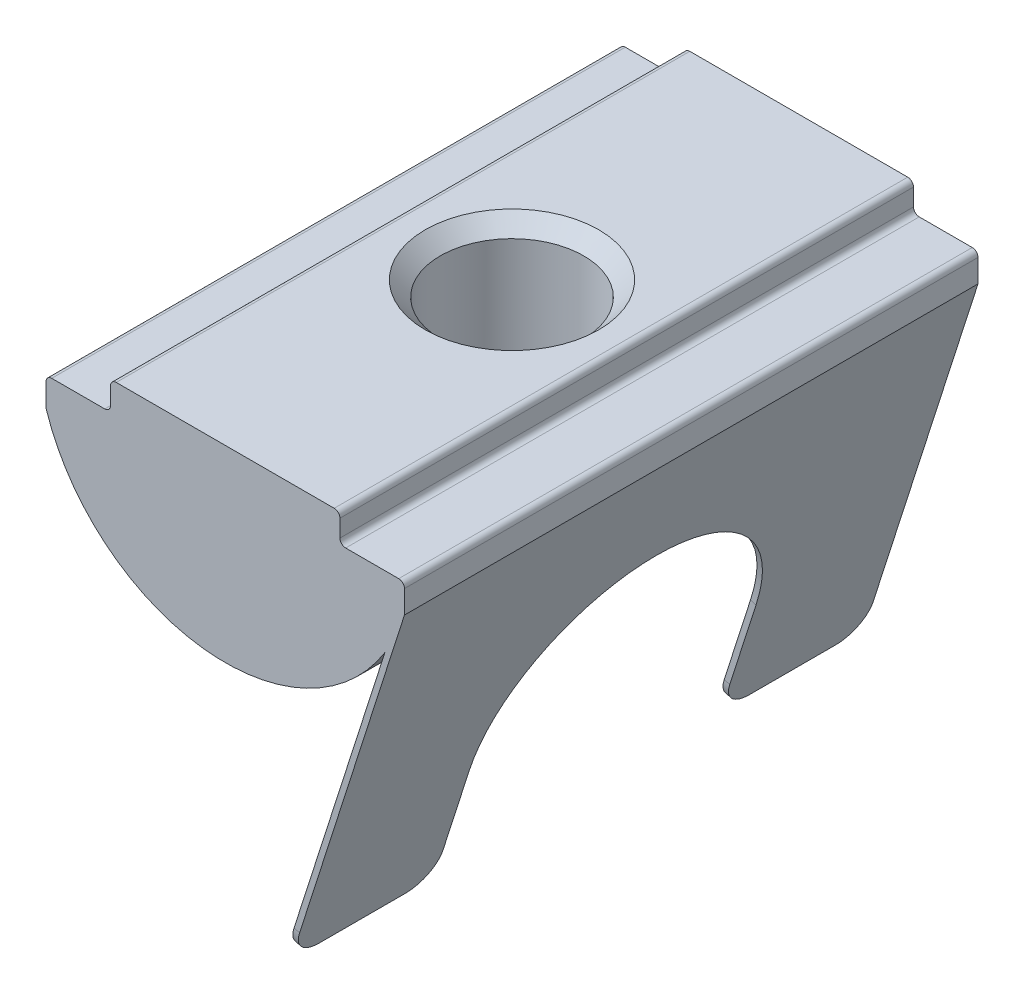
ISO-10303-21;
HEADER;
FILE_DESCRIPTION(('STEP AP214'),'2;1');
FILE_NAME('part.step','',(''),(''),'','','');
FILE_SCHEMA(('AUTOMOTIVE_DESIGN { 1 0 10303 214 1 1 1 1 }'));
ENDSEC;
DATA;
#1=APPLICATION_CONTEXT('core data for automotive mechanical design processes');
#2=APPLICATION_PROTOCOL_DEFINITION('international standard','automotive_design',2000,#1);
#3=PRODUCT_CONTEXT('',#1,'mechanical');
#4=PRODUCT('Part','Part','',(#3));
#5=PRODUCT_RELATED_PRODUCT_CATEGORY('part','',(#4));
#6=PRODUCT_DEFINITION_FORMATION('','',#4);
#7=PRODUCT_DEFINITION_CONTEXT('part definition',#1,'design');
#8=PRODUCT_DEFINITION('design','',#6,#7);
#9=PRODUCT_DEFINITION_SHAPE('','',#8);
#10=(LENGTH_UNIT() NAMED_UNIT(*) SI_UNIT(.MILLI.,.METRE.));
#11=(NAMED_UNIT(*) PLANE_ANGLE_UNIT() SI_UNIT($,.RADIAN.));
#12=(NAMED_UNIT(*) SI_UNIT($,.STERADIAN.) SOLID_ANGLE_UNIT());
#13=UNCERTAINTY_MEASURE_WITH_UNIT(LENGTH_MEASURE(1.E-05),#10,'distance_accuracy_value','');
#14=(GEOMETRIC_REPRESENTATION_CONTEXT(3) GLOBAL_UNCERTAINTY_ASSIGNED_CONTEXT((#13)) GLOBAL_UNIT_ASSIGNED_CONTEXT((#10,
#11,#12)) REPRESENTATION_CONTEXT('',''));
#15=CARTESIAN_POINT('',(0.,0.,0.));
#16=DIRECTION('',(0.,0.,1.));
#17=DIRECTION('',(1.,0.,0.));
#18=AXIS2_PLACEMENT_3D('',#15,#16,#17);
#19=CARTESIAN_POINT('',(2.09743071821094,-14.3205587681705,10.));
#20=DIRECTION('',(0.304775727103784,0.952424147199324,0.));
#21=DIRECTION('',(-0.952424147199324,0.304775727103784,0.));
#22=AXIS2_PLACEMENT_3D('',#19,#20,#21);
#23=PLANE('',#22);
#24=DIRECTION('',(0.,0.,-1.));
#25=VECTOR('',#24,1.);
#26=CARTESIAN_POINT('',(2.09743071821094,-14.3205587681705,10.));
#27=LINE('',#26,#25);
#28=CARTESIAN_POINT('',(2.09743071821094,-14.3205587681705,9.));
#29=VERTEX_POINT('',#28);
#30=CARTESIAN_POINT('',(2.09743071821094,-14.3205587681705,6.));
#31=VERTEX_POINT('',#30);
#32=EDGE_CURVE('E408',#29,#31,#27,.T.);
#33=ORIENTED_EDGE('',*,*,#32,.T.);
#34=DIRECTION('',(0.952424147199324,-0.304775727103784,0.));
#35=VECTOR('',#34,1.);
#36=CARTESIAN_POINT('',(2.09743071821094,-14.3205587681705,6.));
#37=LINE('',#36,#35);
#38=CARTESIAN_POINT('',(2.28791554765081,-14.3815139135912,6.));
#39=VERTEX_POINT('',#38);
#40=EDGE_CURVE('E364',#31,#39,#37,.T.);
#41=ORIENTED_EDGE('',*,*,#40,.T.);
#42=DIRECTION('',(0.,0.,-1.));
#43=VECTOR('',#42,1.);
#44=CARTESIAN_POINT('',(2.28791554765081,-14.3815139135912,10.));
#45=LINE('',#44,#43);
#46=CARTESIAN_POINT('',(2.28791554765081,-14.3815139135912,9.));
#47=VERTEX_POINT('',#46);
#48=EDGE_CURVE('E339',#47,#39,#45,.T.);
#49=ORIENTED_EDGE('',*,*,#48,.F.);
#50=DIRECTION('',(0.952424147199324,-0.304775727103784,0.));
#51=VECTOR('',#50,1.);
#52=CARTESIAN_POINT('',(2.09743071821094,-14.3205587681705,9.));
#53=LINE('',#52,#51);
#54=EDGE_CURVE('E362',#47,#29,#53,.F.);
#55=ORIENTED_EDGE('',*,*,#54,.T.);
#56=EDGE_LOOP('',(#33,#41,#49,#55));
#57=FACE_BOUND('',#56,.T.);
#58=ADVANCED_FACE('F37',(#57),#23,.F.);
#59=CARTESIAN_POINT('',(0.,0.,10.));
#60=DIRECTION('',(0.,0.,-1.));
#61=DIRECTION('',(-1.,0.,0.));
#62=AXIS2_PLACEMENT_3D('',#59,#60,#61);
#63=CYLINDRICAL_SURFACE('',#62,6.56220237420334);
#64=CARTESIAN_POINT('',(0.,-6.56220237420334,2.5));
#65=CARTESIAN_POINT('',(0.135237969727322,-6.5622066098918,2.50000559090245));
#66=CARTESIAN_POINT('',(0.270438294165238,-6.55798574884076,2.48899237795468));
#67=CARTESIAN_POINT('',(0.536790067596159,-6.54157082288729,2.44541562857021));
#68=CARTESIAN_POINT('',(0.66794223689422,-6.52937818510092,2.41285594939247));
#69=CARTESIAN_POINT('',(0.922317274417645,-6.49832593562565,2.3275105667938));
#70=CARTESIAN_POINT('',(1.04555518470677,-6.47947944209069,2.27476464372538));
#71=CARTESIAN_POINT('',(1.28142189377812,-6.43698980028419,2.15074975378287));
#72=CARTESIAN_POINT('',(1.39404774154593,-6.41334532351474,2.07947565516312));
#73=CARTESIAN_POINT('',(1.61040689382471,-6.36254100296364,1.91718290169649));
#74=CARTESIAN_POINT('',(1.7136163655667,-6.33527948599431,1.82549804417402));
#75=CARTESIAN_POINT('',(1.90361954452212,-6.2808056589463,1.62640061830623));
#76=CARTESIAN_POINT('',(1.99040799009793,-6.25359336739741,1.5189830283602));
#77=CARTESIAN_POINT('',(2.14849031868706,-6.20110584528917,1.28628876369987));
#78=CARTESIAN_POINT('',(2.21903508018268,-6.17594989288392,1.16047355196513));
#79=CARTESIAN_POINT('',(2.33772933390275,-6.13201086715651,0.89765620395099));
#80=CARTESIAN_POINT('',(2.3858880983818,-6.1132251561613,0.760658727044491));
#81=CARTESIAN_POINT('',(2.45636012527362,-6.08524333193476,0.485402970483944));
#82=CARTESIAN_POINT('',(2.47967537946486,-6.07567706705736,0.347440147986682));
#83=CARTESIAN_POINT('',(2.50293096270891,-6.0661363899596,0.0692540501262569));
#84=CARTESIAN_POINT('',(2.50288134755941,-6.06615785136304,-0.0709682268271353));
#85=CARTESIAN_POINT('',(2.48017311798589,-6.07547185819711,-0.340420801195307));
#86=CARTESIAN_POINT('',(2.45891837287933,-6.08418872632706,-0.46979304273857));
#87=CARTESIAN_POINT('',(2.39672872804262,-6.10895243063458,-0.722973167947636));
#88=CARTESIAN_POINT('',(2.3557907665065,-6.12500040717709,-0.846780182641857));
#89=CARTESIAN_POINT('',(2.25464716104957,-6.16295558593987,-1.08812773461316));
#90=CARTESIAN_POINT('',(2.19408503593202,-6.18496985318855,-1.20550129697871));
#91=CARTESIAN_POINT('',(2.05566109372734,-6.23234297311382,-1.42882173607091));
#92=CARTESIAN_POINT('',(1.97779317084308,-6.25770300494994,-1.53476456018153));
#93=CARTESIAN_POINT('',(1.80059453364382,-6.31106076406311,-1.73996727508045));
#94=CARTESIAN_POINT('',(1.70014783768017,-6.33911927919591,-1.83825008747681));
#95=CARTESIAN_POINT('',(1.48388058500153,-6.39320034448105,-2.01687157132359));
#96=CARTESIAN_POINT('',(1.36805751636075,-6.41922256087178,-2.09720730512577));
#97=CARTESIAN_POINT('',(1.12176812531848,-6.46684633871997,-2.23877853844));
#98=CARTESIAN_POINT('',(0.991092617477647,-6.48836831111416,-2.29967881040701));
#99=CARTESIAN_POINT('',(0.720326163224393,-6.52397374555269,-2.39830435029323));
#100=CARTESIAN_POINT('',(0.580239571346992,-6.5380606214764,-2.43604025560212));
#101=CARTESIAN_POINT('',(0.30284307236105,-6.55660336858607,-2.48536473017634));
#102=CARTESIAN_POINT('',(0.165799155746944,-6.56154308249374,-2.4982684066475));
#103=CARTESIAN_POINT('',(-0.108569560725787,-6.56273688938799,-2.50140406044084));
#104=CARTESIAN_POINT('',(-0.245894288641204,-6.55899298208926,-2.49164125753091));
#105=CARTESIAN_POINT('',(-0.511178796961527,-6.54355896320154,-2.4507133564302));
#106=CARTESIAN_POINT('',(-0.639293584119852,-6.53219203239229,-2.42041820128547));
#107=CARTESIAN_POINT('',(-0.888525112222872,-6.50298230614948,-2.34043991811526));
#108=CARTESIAN_POINT('',(-1.00964094199354,-6.48513866972419,-2.29075427219697));
#109=CARTESIAN_POINT('',(-1.24547398507779,-6.44407126786509,-2.17180910315483));
#110=CARTESIAN_POINT('',(-1.35989405648471,-6.42070336715714,-2.10201173551177));
#111=CARTESIAN_POINT('',(-1.57578627748461,-6.37116049204239,-1.94542955336869));
#112=CARTESIAN_POINT('',(-1.67725351756103,-6.34498446014602,-1.8586383290765));
#113=CARTESIAN_POINT('',(-1.8707222682355,-6.29075464835007,-1.66441869640802));
#114=CARTESIAN_POINT('',(-1.96179260631359,-6.26268231760205,-1.55606547646505));
#115=CARTESIAN_POINT('',(-2.12465242533068,-6.20932501921404,-1.32507440268299));
#116=CARTESIAN_POINT('',(-2.19643986730368,-6.18404034650645,-1.20243504019683));
#117=CARTESIAN_POINT('',(-2.31885011487335,-6.139196109236,-0.945158222699218));
#118=CARTESIAN_POINT('',(-2.36935793657373,-6.11966781525425,-0.810460235131746));
#119=CARTESIAN_POINT('',(-2.44662901393818,-6.08919247750817,-0.533515110525692));
#120=CARTESIAN_POINT('',(-2.47340760775104,-6.07823989109353,-0.391272913049802));
#121=CARTESIAN_POINT('',(-2.50106641197949,-6.06690770485394,-0.113403243873322));
#122=CARTESIAN_POINT('',(-2.50354106563636,-6.06587726377154,0.0220402142339864));
#123=CARTESIAN_POINT('',(-2.48663064429201,-6.07282885779216,0.291306728413155));
#124=CARTESIAN_POINT('',(-2.46724778375513,-6.08080997990102,0.425129947249094));
#125=CARTESIAN_POINT('',(-2.40842883548723,-6.10433590438406,0.682929434330561));
#126=CARTESIAN_POINT('',(-2.36966536663656,-6.11962629938865,0.807084400051815));
#127=CARTESIAN_POINT('',(-2.27378641928747,-6.15589224411625,1.04719592320177));
#128=CARTESIAN_POINT('',(-2.21666623282566,-6.17686925207367,1.16315036811762));
#129=CARTESIAN_POINT('',(-2.0821447559704,-6.22354349256986,1.39033189832229));
#130=CARTESIAN_POINT('',(-2.00382030521855,-6.24943349746364,1.50097222563478));
#131=CARTESIAN_POINT('',(-1.83052366787169,-6.30237140427464,1.70804729807096));
#132=CARTESIAN_POINT('',(-1.73554610477584,-6.32941967800402,1.80447743683685));
#133=CARTESIAN_POINT('',(-1.52522171500721,-6.38346458088073,1.98596451770642));
#134=CARTESIAN_POINT('',(-1.40902654879827,-6.41037173144652,2.07006949925358));
#135=CARTESIAN_POINT('',(-1.16320296590711,-6.45950143502143,2.21754467691023));
#136=CARTESIAN_POINT('',(-1.03357276443138,-6.4817233644238,2.28091211345463));
#137=CARTESIAN_POINT('',(-0.756694602572169,-6.52000719349644,2.38760023502498));
#138=CARTESIAN_POINT('',(-0.608863961792611,-6.53564687786252,2.42957584223565));
#139=CARTESIAN_POINT('',(-0.307337189901119,-6.55673928800033,2.48576498850311));
#140=CARTESIAN_POINT('',(-0.153644299986202,-6.56219756202383,2.49999364815742));
#141=CARTESIAN_POINT('',(0.,-6.56220237420334,2.5));
#142=B_SPLINE_CURVE_WITH_KNOTS('',3,(#64,#65,#66,#67,#68,#69,#70,#71,#72,#73,#74,#75,#76,#77,
#78,#79,#80,#81,#82,#83,#84,#85,#86,#87,#88,#89,#90,#91,#92,#93,#94,#95,#96,#97,#98,#99,#100,
#101,#102,#103,#104,#105,#106,#107,#108,#109,#110,#111,#112,#113,#114,#115,#116,#117,#118,#119,
#120,#121,#122,#123,#124,#125,#126,#127,#128,#129,#130,#131,#132,#133,#134,#135,#136,#137,#138,
#139,#140,#141),.UNSPECIFIED.,.T.,.F.,(4,2,2,2,2,2,2,2,2,2,2,2,2,2,2,2,2,2,2,2,2,2,2,2,2,2,2,2,
2,2,2,2,2,2,2,2,2,2,4),(0.,0.405147022189402,0.810221534373831,1.21450185644434,1.6188942714909,
2.03918856687786,2.45961730605884,2.89668447165458,3.33357044285939,3.7520784860493,
4.17040641146018,4.56276247807681,4.95517959706282,5.35516734714124,5.75529644477115,
6.18325103680568,6.61127562688604,7.04632723609394,7.48117891398771,7.89228849121805,
8.30330340514937,8.69791050452409,9.09256886145383,9.4989563495042,9.90549741627367,
10.336392358402,10.7673328452753,11.2005729367009,11.6335327847702,12.0378824800473,
12.4421912128648,12.8333520233495,13.224613235358,13.6368514983554,14.0492230994457,
14.4849223117352,14.9206794793852,15.3812193769187,15.8415082347099),.UNSPECIFIED.);
#143=CARTESIAN_POINT('',(0.,-6.56220237420334,2.5));
#144=VERTEX_POINT('',#143);
#145=EDGE_CURVE('E273',#144,#144,#142,.T.);
#146=ORIENTED_EDGE('',*,*,#145,.T.);
#147=EDGE_LOOP('',(#146));
#148=FACE_BOUND('',#147,.T.);
#149=DIRECTION('',(0.,0.,-1.));
#150=VECTOR('',#149,1.);
#151=CARTESIAN_POINT('',(5.56951001555688,-3.47031096396441,10.));
#152=LINE('',#151,#150);
#153=CARTESIAN_POINT('',(5.56951001555688,-3.47031096396441,10.));
#154=VERTEX_POINT('',#153);
#155=CARTESIAN_POINT('',(5.56951001555688,-3.47031096396441,-10.));
#156=VERTEX_POINT('',#155);
#157=EDGE_CURVE('E410',#154,#156,#152,.T.);
#158=ORIENTED_EDGE('',*,*,#157,.F.);
#159=CARTESIAN_POINT('',(0.,0.,10.));
#160=DIRECTION('',(0.,0.,1.));
#161=DIRECTION('',(1.,0.,0.));
#162=AXIS2_PLACEMENT_3D('',#159,#160,#161);
#163=CIRCLE('',#162,6.56220237420334);
#164=CARTESIAN_POINT('',(-6.25,-2.,10.));
#165=VERTEX_POINT('',#164);
#166=EDGE_CURVE('E238',#165,#154,#163,.T.);
#167=ORIENTED_EDGE('',*,*,#166,.F.);
#168=DIRECTION('',(0.,0.,-1.));
#169=VECTOR('',#168,1.);
#170=CARTESIAN_POINT('',(-6.25,-2.,10.));
#171=LINE('',#170,#169);
#172=CARTESIAN_POINT('',(-6.25,-2.,-10.));
#173=VERTEX_POINT('',#172);
#174=EDGE_CURVE('E232',#165,#173,#171,.T.);
#175=ORIENTED_EDGE('',*,*,#174,.T.);
#176=CARTESIAN_POINT('',(0.,0.,-10.));
#177=DIRECTION('',(0.,0.,1.));
#178=DIRECTION('',(1.,0.,0.));
#179=AXIS2_PLACEMENT_3D('',#176,#177,#178);
#180=CIRCLE('',#179,6.56220237420334);
#181=EDGE_CURVE('E262',#173,#156,#180,.T.);
#182=ORIENTED_EDGE('',*,*,#181,.T.);
#183=EDGE_LOOP('',(#158,#167,#175,#182));
#184=FACE_BOUND('',#183,.T.);
#185=ADVANCED_FACE('F283',(#148,#184),#63,.T.);
#186=CARTESIAN_POINT('',(4.,-0.999999999999999,10.));
#187=DIRECTION('',(-1.,0.,0.));
#188=DIRECTION('',(0.,0.,1.));
#189=AXIS2_PLACEMENT_3D('',#186,#187,#188);
#190=PLANE('',#189);
#191=DIRECTION('',(0.,1.,0.));
#192=VECTOR('',#191,1.);
#193=CARTESIAN_POINT('',(4.,-0.999999999999999,10.));
#194=LINE('',#193,#192);
#195=CARTESIAN_POINT('',(4.,-0.799999999999998,10.));
#196=VERTEX_POINT('',#195);
#197=CARTESIAN_POINT('',(4.,-0.2,10.));
#198=VERTEX_POINT('',#197);
#199=EDGE_CURVE('E269',#196,#198,#194,.T.);
#200=ORIENTED_EDGE('',*,*,#199,.F.);
#201=DIRECTION('',(0.,0.,-1.));
#202=VECTOR('',#201,1.);
#203=CARTESIAN_POINT('',(4.,-0.799999999999998,-10.));
#204=LINE('',#203,#202);
#205=CARTESIAN_POINT('',(4.,-0.799999999999998,-10.));
#206=VERTEX_POINT('',#205);
#207=EDGE_CURVE('E488',#196,#206,#204,.T.);
#208=ORIENTED_EDGE('',*,*,#207,.T.);
#209=DIRECTION('',(0.,1.,0.));
#210=VECTOR('',#209,1.);
#211=CARTESIAN_POINT('',(4.,-0.999999999999999,-10.));
#212=LINE('',#211,#210);
#213=CARTESIAN_POINT('',(4.,-0.2,-10.));
#214=VERTEX_POINT('',#213);
#215=EDGE_CURVE('E247',#206,#214,#212,.T.);
#216=ORIENTED_EDGE('',*,*,#215,.T.);
#217=DIRECTION('',(0.,0.,-1.));
#218=VECTOR('',#217,1.);
#219=CARTESIAN_POINT('',(4.,-0.2,10.));
#220=LINE('',#219,#218);
#221=EDGE_CURVE('E491',#214,#198,#220,.F.);
#222=ORIENTED_EDGE('',*,*,#221,.T.);
#223=EDGE_LOOP('',(#200,#208,#216,#222));
#224=FACE_BOUND('',#223,.T.);
#225=ADVANCED_FACE('F318',(#224),#190,.F.);
#226=CARTESIAN_POINT('',(-4.,0.,10.));
#227=DIRECTION('',(0.,-1.,0.));
#228=DIRECTION('',(0.,0.,-1.));
#229=AXIS2_PLACEMENT_3D('',#226,#227,#228);
#230=PLANE('',#229);
#231=CARTESIAN_POINT('',(0.,0.,0.));
#232=DIRECTION('',(0.,1.,0.));
#233=DIRECTION('',(0.,0.,1.));
#234=AXIS2_PLACEMENT_3D('',#231,#232,#233);
#235=CIRCLE('',#234,3.025);
#236=CARTESIAN_POINT('',(0.,0.,3.025));
#237=VERTEX_POINT('',#236);
#238=EDGE_CURVE('E413',#237,#237,#235,.T.);
#239=ORIENTED_EDGE('',*,*,#238,.F.);
#240=EDGE_LOOP('',(#239));
#241=FACE_BOUND('',#240,.T.);
#242=DIRECTION('',(-1.,0.,0.));
#243=VECTOR('',#242,1.);
#244=CARTESIAN_POINT('',(-4.,0.,10.));
#245=LINE('',#244,#243);
#246=CARTESIAN_POINT('',(3.8,0.,10.));
#247=VERTEX_POINT('',#246);
#248=CARTESIAN_POINT('',(-3.8,0.,10.));
#249=VERTEX_POINT('',#248);
#250=EDGE_CURVE('E420',#247,#249,#245,.T.);
#251=ORIENTED_EDGE('',*,*,#250,.F.);
#252=DIRECTION('',(0.,0.,-1.));
#253=VECTOR('',#252,1.);
#254=CARTESIAN_POINT('',(3.8,0.,10.));
#255=LINE('',#254,#253);
#256=CARTESIAN_POINT('',(3.8,0.,-10.));
#257=VERTEX_POINT('',#256);
#258=EDGE_CURVE('E483',#247,#257,#255,.T.);
#259=ORIENTED_EDGE('',*,*,#258,.T.);
#260=DIRECTION('',(-1.,0.,0.));
#261=VECTOR('',#260,1.);
#262=CARTESIAN_POINT('',(-4.,0.,-10.));
#263=LINE('',#262,#261);
#264=CARTESIAN_POINT('',(-3.8,0.,-10.));
#265=VERTEX_POINT('',#264);
#266=EDGE_CURVE('E250',#257,#265,#263,.T.);
#267=ORIENTED_EDGE('',*,*,#266,.T.);
#268=DIRECTION('',(0.,0.,-1.));
#269=VECTOR('',#268,1.);
#270=CARTESIAN_POINT('',(-3.8,0.,10.));
#271=LINE('',#270,#269);
#272=EDGE_CURVE('E486',#265,#249,#271,.F.);
#273=ORIENTED_EDGE('',*,*,#272,.T.);
#274=EDGE_LOOP('',(#251,#259,#267,#273));
#275=FACE_BOUND('',#274,.T.);
#276=ADVANCED_FACE('F529',(#241,#275),#230,.F.);
#277=CARTESIAN_POINT('',(-4.,0.,10.));
#278=DIRECTION('',(1.,0.,0.));
#279=DIRECTION('',(0.,0.,-1.));
#280=AXIS2_PLACEMENT_3D('',#277,#278,#279);
#281=PLANE('',#280);
#282=DIRECTION('',(0.,-1.,0.));
#283=VECTOR('',#282,1.);
#284=CARTESIAN_POINT('',(-4.,0.,-10.));
#285=LINE('',#284,#283);
#286=CARTESIAN_POINT('',(-4.,-0.2,-10.));
#287=VERTEX_POINT('',#286);
#288=CARTESIAN_POINT('',(-4.,-0.8,-10.));
#289=VERTEX_POINT('',#288);
#290=EDGE_CURVE('E254',#287,#289,#285,.T.);
#291=ORIENTED_EDGE('',*,*,#290,.T.);
#292=DIRECTION('',(0.,0.,-1.));
#293=VECTOR('',#292,1.);
#294=CARTESIAN_POINT('',(-4.,-0.8,10.));
#295=LINE('',#294,#293);
#296=CARTESIAN_POINT('',(-4.,-0.8,10.));
#297=VERTEX_POINT('',#296);
#298=EDGE_CURVE('E471',#289,#297,#295,.F.);
#299=ORIENTED_EDGE('',*,*,#298,.T.);
#300=DIRECTION('',(0.,-1.,0.));
#301=VECTOR('',#300,1.);
#302=CARTESIAN_POINT('',(-4.,0.,10.));
#303=LINE('',#302,#301);
#304=CARTESIAN_POINT('',(-4.,-0.2,10.));
#305=VERTEX_POINT('',#304);
#306=EDGE_CURVE('E423',#305,#297,#303,.T.);
#307=ORIENTED_EDGE('',*,*,#306,.F.);
#308=DIRECTION('',(0.,0.,-1.));
#309=VECTOR('',#308,1.);
#310=CARTESIAN_POINT('',(-4.,-0.2,10.));
#311=LINE('',#310,#309);
#312=EDGE_CURVE('E473',#305,#287,#311,.T.);
#313=ORIENTED_EDGE('',*,*,#312,.T.);
#314=EDGE_LOOP('',(#291,#299,#307,#313));
#315=FACE_BOUND('',#314,.T.);
#316=ADVANCED_FACE('F538',(#315),#281,.F.);
#317=CARTESIAN_POINT('',(-4.,-1.,10.));
#318=DIRECTION('',(0.,-1.,0.));
#319=DIRECTION('',(1.,0.,0.));
#320=AXIS2_PLACEMENT_3D('',#317,#318,#319);
#321=PLANE('',#320);
#322=DIRECTION('',(-1.,0.,0.));
#323=VECTOR('',#322,1.);
#324=CARTESIAN_POINT('',(-4.,-1.,-10.));
#325=LINE('',#324,#323);
#326=CARTESIAN_POINT('',(-4.2,-1.,-10.));
#327=VERTEX_POINT('',#326);
#328=CARTESIAN_POINT('',(-6.05,-1.,-10.));
#329=VERTEX_POINT('',#328);
#330=EDGE_CURVE('E257',#327,#329,#325,.T.);
#331=ORIENTED_EDGE('',*,*,#330,.T.);
#332=DIRECTION('',(0.,0.,-1.));
#333=VECTOR('',#332,1.);
#334=CARTESIAN_POINT('',(-6.05,-1.,10.));
#335=LINE('',#334,#333);
#336=CARTESIAN_POINT('',(-6.05,-1.,10.));
#337=VERTEX_POINT('',#336);
#338=EDGE_CURVE('E476',#329,#337,#335,.F.);
#339=ORIENTED_EDGE('',*,*,#338,.T.);
#340=DIRECTION('',(-1.,0.,0.));
#341=VECTOR('',#340,1.);
#342=CARTESIAN_POINT('',(-4.,-1.,10.));
#343=LINE('',#342,#341);
#344=CARTESIAN_POINT('',(-4.2,-1.,10.));
#345=VERTEX_POINT('',#344);
#346=EDGE_CURVE('E426',#345,#337,#343,.T.);
#347=ORIENTED_EDGE('',*,*,#346,.F.);
#348=DIRECTION('',(0.,0.,-1.));
#349=VECTOR('',#348,1.);
#350=CARTESIAN_POINT('',(-4.2,-1.,-10.));
#351=LINE('',#350,#349);
#352=EDGE_CURVE('E478',#345,#327,#351,.T.);
#353=ORIENTED_EDGE('',*,*,#352,.T.);
#354=EDGE_LOOP('',(#331,#339,#347,#353));
#355=FACE_BOUND('',#354,.T.);
#356=ADVANCED_FACE('F309',(#355),#321,.F.);
#357=CARTESIAN_POINT('',(-6.25,-1.,10.));
#358=DIRECTION('',(1.,0.,0.));
#359=DIRECTION('',(0.,1.,0.));
#360=AXIS2_PLACEMENT_3D('',#357,#358,#359);
#361=PLANE('',#360);
#362=DIRECTION('',(0.,-1.,0.));
#363=VECTOR('',#362,1.);
#364=CARTESIAN_POINT('',(-6.25,-1.,10.));
#365=LINE('',#364,#363);
#366=CARTESIAN_POINT('',(-6.25,-1.2,10.));
#367=VERTEX_POINT('',#366);
#368=EDGE_CURVE('E243',#367,#165,#365,.T.);
#369=ORIENTED_EDGE('',*,*,#368,.F.);
#370=DIRECTION('',(0.,0.,-1.));
#371=VECTOR('',#370,1.);
#372=CARTESIAN_POINT('',(-6.25,-1.2,10.));
#373=LINE('',#372,#371);
#374=CARTESIAN_POINT('',(-6.25,-1.2,-10.));
#375=VERTEX_POINT('',#374);
#376=EDGE_CURVE('E481',#367,#375,#373,.T.);
#377=ORIENTED_EDGE('',*,*,#376,.T.);
#378=DIRECTION('',(0.,-1.,0.));
#379=VECTOR('',#378,1.);
#380=CARTESIAN_POINT('',(-6.25,-1.,-10.));
#381=LINE('',#380,#379);
#382=EDGE_CURVE('E260',#375,#173,#381,.T.);
#383=ORIENTED_EDGE('',*,*,#382,.T.);
#384=ORIENTED_EDGE('',*,*,#174,.F.);
#385=EDGE_LOOP('',(#369,#377,#383,#384));
#386=FACE_BOUND('',#385,.T.);
#387=ADVANCED_FACE('F305',(#386),#361,.F.);
#388=CARTESIAN_POINT('',(6.25,-0.999999999999999,10.));
#389=DIRECTION('',(-1.,0.,0.));
#390=DIRECTION('',(0.,0.,1.));
#391=AXIS2_PLACEMENT_3D('',#388,#389,#390);
#392=PLANE('',#391);
#393=DIRECTION('',(0.,1.,0.));
#394=VECTOR('',#393,1.);
#395=CARTESIAN_POINT('',(6.25,-0.999999999999999,-10.));
#396=LINE('',#395,#394);
#397=CARTESIAN_POINT('',(6.25,-2.,-10.));
#398=VERTEX_POINT('',#397);
#399=CARTESIAN_POINT('',(6.25,-1.2,-10.));
#400=VERTEX_POINT('',#399);
#401=EDGE_CURVE('E265',#398,#400,#396,.T.);
#402=ORIENTED_EDGE('',*,*,#401,.T.);
#403=DIRECTION('',(0.,0.,-1.));
#404=VECTOR('',#403,1.);
#405=CARTESIAN_POINT('',(6.25,-1.2,10.));
#406=LINE('',#405,#404);
#407=CARTESIAN_POINT('',(6.25,-1.2,10.));
#408=VERTEX_POINT('',#407);
#409=EDGE_CURVE('E237',#400,#408,#406,.F.);
#410=ORIENTED_EDGE('',*,*,#409,.T.);
#411=DIRECTION('',(0.,1.,0.));
#412=VECTOR('',#411,1.);
#413=CARTESIAN_POINT('',(6.25,-0.999999999999999,10.));
#414=LINE('',#413,#412);
#415=CARTESIAN_POINT('',(6.25,-2.,10.));
#416=VERTEX_POINT('',#415);
#417=EDGE_CURVE('E216',#416,#408,#414,.T.);
#418=ORIENTED_EDGE('',*,*,#417,.F.);
#419=DIRECTION('',(0.,0.,-1.));
#420=VECTOR('',#419,1.);
#421=CARTESIAN_POINT('',(6.25,-2.,10.));
#422=LINE('',#421,#420);
#423=EDGE_CURVE('E224',#416,#398,#422,.T.);
#424=ORIENTED_EDGE('',*,*,#423,.T.);
#425=EDGE_LOOP('',(#402,#410,#418,#424));
#426=FACE_BOUND('',#425,.T.);
#427=ADVANCED_FACE('F235',(#426),#392,.F.);
#428=CARTESIAN_POINT('',(4.,-0.999999999999999,10.));
#429=DIRECTION('',(0.,-1.,0.));
#430=DIRECTION('',(1.,0.,0.));
#431=AXIS2_PLACEMENT_3D('',#428,#429,#430);
#432=PLANE('',#431);
#433=DIRECTION('',(-1.,0.,0.));
#434=VECTOR('',#433,1.);
#435=CARTESIAN_POINT('',(4.,-0.999999999999999,10.));
#436=LINE('',#435,#434);
#437=CARTESIAN_POINT('',(6.05,-0.999999999999999,10.));
#438=VERTEX_POINT('',#437);
#439=CARTESIAN_POINT('',(4.2,-0.999999999999999,10.));
#440=VERTEX_POINT('',#439);
#441=EDGE_CURVE('E233',#438,#440,#436,.T.);
#442=ORIENTED_EDGE('',*,*,#441,.F.);
#443=DIRECTION('',(0.,0.,-1.));
#444=VECTOR('',#443,1.);
#445=CARTESIAN_POINT('',(6.05,-0.999999999999999,10.));
#446=LINE('',#445,#444);
#447=CARTESIAN_POINT('',(6.05,-0.999999999999999,-10.));
#448=VERTEX_POINT('',#447);
#449=EDGE_CURVE('E508',#438,#448,#446,.T.);
#450=ORIENTED_EDGE('',*,*,#449,.T.);
#451=DIRECTION('',(-1.,0.,0.));
#452=VECTOR('',#451,1.);
#453=CARTESIAN_POINT('',(4.,-0.999999999999999,-10.));
#454=LINE('',#453,#452);
#455=CARTESIAN_POINT('',(4.2,-0.999999999999999,-10.));
#456=VERTEX_POINT('',#455);
#457=EDGE_CURVE('E267',#448,#456,#454,.T.);
#458=ORIENTED_EDGE('',*,*,#457,.T.);
#459=DIRECTION('',(0.,0.,-1.));
#460=VECTOR('',#459,1.);
#461=CARTESIAN_POINT('',(4.2,-0.999999999999999,10.));
#462=LINE('',#461,#460);
#463=EDGE_CURVE('E281',#456,#440,#462,.F.);
#464=ORIENTED_EDGE('',*,*,#463,.T.);
#465=EDGE_LOOP('',(#442,#450,#458,#464));
#466=FACE_BOUND('',#465,.T.);
#467=ADVANCED_FACE('F298',(#466),#432,.F.);
#468=CARTESIAN_POINT('',(0.,0.,10.));
#469=DIRECTION('',(0.,0.,1.));
#470=DIRECTION('',(1.,0.,0.));
#471=AXIS2_PLACEMENT_3D('',#468,#469,#470);
#472=PLANE('',#471);
#473=DIRECTION('',(-0.304775727103784,-0.952424147199324,0.));
#474=VECTOR('',#473,1.);
#475=CARTESIAN_POINT('',(6.05951517056013,-1.93904485457925,10.));
#476=LINE('',#475,#474);
#477=CARTESIAN_POINT('',(2.40220644531473,-13.3681346209711,10.));
#478=VERTEX_POINT('',#477);
#479=EDGE_CURVE('E221',#154,#478,#476,.T.);
#480=ORIENTED_EDGE('',*,*,#479,.T.);
#481=DIRECTION('',(0.952424147199324,-0.304775727103784,0.));
#482=VECTOR('',#481,1.);
#483=CARTESIAN_POINT('',(2.59269127475459,-13.4290897663919,10.));
#484=LINE('',#483,#482);
#485=CARTESIAN_POINT('',(2.59269127475459,-13.4290897663919,10.));
#486=VERTEX_POINT('',#485);
#487=EDGE_CURVE('E219',#478,#486,#484,.T.);
#488=ORIENTED_EDGE('',*,*,#487,.T.);
#489=DIRECTION('',(0.304775727103784,0.952424147199324,0.));
#490=VECTOR('',#489,1.);
#491=CARTESIAN_POINT('',(6.25,-2.,10.));
#492=LINE('',#491,#490);
#493=EDGE_CURVE('E211',#486,#416,#492,.T.);
#494=ORIENTED_EDGE('',*,*,#493,.T.);
#495=ORIENTED_EDGE('',*,*,#417,.T.);
#496=CARTESIAN_POINT('',(6.05,-1.2,10.));
#497=DIRECTION('',(0.,0.,1.));
#498=DIRECTION('',(1.,0.,0.));
#499=AXIS2_PLACEMENT_3D('',#496,#497,#498);
#500=CIRCLE('',#499,0.2);
#501=EDGE_CURVE('E493',#408,#438,#500,.T.);
#502=ORIENTED_EDGE('',*,*,#501,.T.);
#503=ORIENTED_EDGE('',*,*,#441,.T.);
#504=CARTESIAN_POINT('',(4.2,-0.799999999999998,10.));
#505=DIRECTION('',(0.,0.,1.));
#506=DIRECTION('',(1.,0.,0.));
#507=AXIS2_PLACEMENT_3D('',#504,#505,#506);
#508=CIRCLE('',#507,0.2);
#509=EDGE_CURVE('E467',#440,#196,#508,.F.);
#510=ORIENTED_EDGE('',*,*,#509,.T.);
#511=ORIENTED_EDGE('',*,*,#199,.T.);
#512=CARTESIAN_POINT('',(3.8,-0.2,10.));
#513=DIRECTION('',(0.,0.,1.));
#514=DIRECTION('',(1.,0.,0.));
#515=AXIS2_PLACEMENT_3D('',#512,#513,#514);
#516=CIRCLE('',#515,0.2);
#517=EDGE_CURVE('E495',#198,#247,#516,.T.);
#518=ORIENTED_EDGE('',*,*,#517,.T.);
#519=ORIENTED_EDGE('',*,*,#250,.T.);
#520=CARTESIAN_POINT('',(-3.8,-0.2,10.));
#521=DIRECTION('',(0.,0.,1.));
#522=DIRECTION('',(1.,0.,0.));
#523=AXIS2_PLACEMENT_3D('',#520,#521,#522);
#524=CIRCLE('',#523,0.2);
#525=EDGE_CURVE('E498',#249,#305,#524,.T.);
#526=ORIENTED_EDGE('',*,*,#525,.T.);
#527=ORIENTED_EDGE('',*,*,#306,.T.);
#528=CARTESIAN_POINT('',(-4.2,-0.8,10.));
#529=DIRECTION('',(0.,0.,1.));
#530=DIRECTION('',(1.,0.,0.));
#531=AXIS2_PLACEMENT_3D('',#528,#529,#530);
#532=CIRCLE('',#531,0.2);
#533=EDGE_CURVE('E463',#297,#345,#532,.F.);
#534=ORIENTED_EDGE('',*,*,#533,.T.);
#535=ORIENTED_EDGE('',*,*,#346,.T.);
#536=CARTESIAN_POINT('',(-6.05,-1.2,10.));
#537=DIRECTION('',(0.,0.,1.));
#538=DIRECTION('',(1.,0.,0.));
#539=AXIS2_PLACEMENT_3D('',#536,#537,#538);
#540=CIRCLE('',#539,0.2);
#541=EDGE_CURVE('E432',#337,#367,#540,.T.);
#542=ORIENTED_EDGE('',*,*,#541,.T.);
#543=ORIENTED_EDGE('',*,*,#368,.T.);
#544=ORIENTED_EDGE('',*,*,#166,.T.);
#545=EDGE_LOOP('',(#480,#488,#494,#495,#502,#503,#510,#511,#518,#519,#526,#527,#534,#535,#542,
#543,#544));
#546=FACE_BOUND('',#545,.T.);
#547=ADVANCED_FACE('F214',(#546),#472,.T.);
#548=CARTESIAN_POINT('',(0.,0.,-10.));
#549=DIRECTION('',(0.,0.,1.));
#550=DIRECTION('',(1.,0.,0.));
#551=AXIS2_PLACEMENT_3D('',#548,#549,#550);
#552=PLANE('',#551);
#553=DIRECTION('',(0.304775727103784,0.952424147199324,0.));
#554=VECTOR('',#553,1.);
#555=CARTESIAN_POINT('',(6.25,-2.,-10.));
#556=LINE('',#555,#554);
#557=CARTESIAN_POINT('',(2.59269127475459,-13.4290897663919,-10.));
#558=VERTEX_POINT('',#557);
#559=EDGE_CURVE('E228',#558,#398,#556,.T.);
#560=ORIENTED_EDGE('',*,*,#559,.F.);
#561=DIRECTION('',(0.952424147199324,-0.304775727103784,0.));
#562=VECTOR('',#561,1.);
#563=CARTESIAN_POINT('',(-3.65730872524541,-11.4290897663919,-10.));
#564=LINE('',#563,#562);
#565=CARTESIAN_POINT('',(2.40220644531473,-13.3681346209711,-10.));
#566=VERTEX_POINT('',#565);
#567=EDGE_CURVE('E360',#558,#566,#564,.F.);
#568=ORIENTED_EDGE('',*,*,#567,.T.);
#569=DIRECTION('',(-0.304775727103784,-0.952424147199324,0.));
#570=VECTOR('',#569,1.);
#571=CARTESIAN_POINT('',(6.05951517056013,-1.93904485457925,-10.));
#572=LINE('',#571,#570);
#573=EDGE_CURVE('E386',#156,#566,#572,.T.);
#574=ORIENTED_EDGE('',*,*,#573,.F.);
#575=ORIENTED_EDGE('',*,*,#181,.F.);
#576=ORIENTED_EDGE('',*,*,#382,.F.);
#577=CARTESIAN_POINT('',(-6.05,-1.2,-10.));
#578=DIRECTION('',(0.,0.,1.));
#579=DIRECTION('',(1.,0.,0.));
#580=AXIS2_PLACEMENT_3D('',#577,#578,#579);
#581=CIRCLE('',#580,0.2);
#582=EDGE_CURVE('E505',#375,#329,#581,.F.);
#583=ORIENTED_EDGE('',*,*,#582,.T.);
#584=ORIENTED_EDGE('',*,*,#330,.F.);
#585=CARTESIAN_POINT('',(-4.2,-0.8,-10.));
#586=DIRECTION('',(0.,0.,1.));
#587=DIRECTION('',(1.,0.,0.));
#588=AXIS2_PLACEMENT_3D('',#585,#586,#587);
#589=CIRCLE('',#588,0.2);
#590=EDGE_CURVE('E465',#327,#289,#589,.T.);
#591=ORIENTED_EDGE('',*,*,#590,.T.);
#592=ORIENTED_EDGE('',*,*,#290,.F.);
#593=CARTESIAN_POINT('',(-3.8,-0.2,-10.));
#594=DIRECTION('',(0.,0.,1.));
#595=DIRECTION('',(1.,0.,0.));
#596=AXIS2_PLACEMENT_3D('',#593,#594,#595);
#597=CIRCLE('',#596,0.2);
#598=EDGE_CURVE('E507',#287,#265,#597,.F.);
#599=ORIENTED_EDGE('',*,*,#598,.T.);
#600=ORIENTED_EDGE('',*,*,#266,.F.);
#601=CARTESIAN_POINT('',(3.8,-0.2,-10.));
#602=DIRECTION('',(0.,0.,1.));
#603=DIRECTION('',(1.,0.,0.));
#604=AXIS2_PLACEMENT_3D('',#601,#602,#603);
#605=CIRCLE('',#604,0.2);
#606=EDGE_CURVE('E503',#257,#214,#605,.F.);
#607=ORIENTED_EDGE('',*,*,#606,.T.);
#608=ORIENTED_EDGE('',*,*,#215,.F.);
#609=CARTESIAN_POINT('',(4.2,-0.799999999999998,-10.));
#610=DIRECTION('',(0.,0.,1.));
#611=DIRECTION('',(1.,0.,0.));
#612=AXIS2_PLACEMENT_3D('',#609,#610,#611);
#613=CIRCLE('',#612,0.2);
#614=EDGE_CURVE('E469',#206,#456,#613,.T.);
#615=ORIENTED_EDGE('',*,*,#614,.T.);
#616=ORIENTED_EDGE('',*,*,#457,.F.);
#617=CARTESIAN_POINT('',(6.05,-1.2,-10.));
#618=DIRECTION('',(0.,0.,1.));
#619=DIRECTION('',(1.,0.,0.));
#620=AXIS2_PLACEMENT_3D('',#617,#618,#619);
#621=CIRCLE('',#620,0.2);
#622=EDGE_CURVE('E501',#448,#400,#621,.F.);
#623=ORIENTED_EDGE('',*,*,#622,.T.);
#624=ORIENTED_EDGE('',*,*,#401,.F.);
#625=EDGE_LOOP('',(#560,#568,#574,#575,#576,#583,#584,#591,#592,#599,#600,#607,#608,#615,#616,
#623,#624));
#626=FACE_BOUND('',#625,.T.);
#627=ADVANCED_FACE('F293',(#626),#552,.F.);
#628=CARTESIAN_POINT('',(0.,0.,0.));
#629=DIRECTION('',(0.,1.,0.));
#630=DIRECTION('',(0.,0.,1.));
#631=AXIS2_PLACEMENT_3D('',#628,#629,#630);
#632=CYLINDRICAL_SURFACE('',#631,2.5);
#633=CARTESIAN_POINT('',(0.,-0.524999999999999,0.));
#634=DIRECTION('',(0.,1.,0.));
#635=DIRECTION('',(0.,0.,1.));
#636=AXIS2_PLACEMENT_3D('',#633,#634,#635);
#637=CIRCLE('',#636,2.5);
#638=CARTESIAN_POINT('',(0.,-0.524999999999999,2.5));
#639=VERTEX_POINT('',#638);
#640=EDGE_CURVE('E251',#639,#639,#637,.T.);
#641=ORIENTED_EDGE('',*,*,#640,.T.);
#642=EDGE_LOOP('',(#641));
#643=FACE_BOUND('',#642,.T.);
#644=ORIENTED_EDGE('',*,*,#145,.F.);
#645=EDGE_LOOP('',(#644));
#646=FACE_BOUND('',#645,.T.);
#647=ADVANCED_FACE('F287',(#643,#646),#632,.F.);
#648=CARTESIAN_POINT('',(0.,0.,0.));
#649=DIRECTION('',(0.,1.,0.));
#650=DIRECTION('',(0.,0.,1.));
#651=AXIS2_PLACEMENT_3D('',#648,#649,#650);
#652=CONICAL_SURFACE('',#651,3.025,0.78539816339745);
#653=ORIENTED_EDGE('',*,*,#640,.F.);
#654=EDGE_LOOP('',(#653));
#655=FACE_BOUND('',#654,.T.);
#656=ORIENTED_EDGE('',*,*,#238,.T.);
#657=EDGE_LOOP('',(#656));
#658=FACE_BOUND('',#657,.T.);
#659=ADVANCED_FACE('F292',(#655,#658),#652,.F.);
#660=CARTESIAN_POINT('',(6.05951517056013,-1.93904485457925,10.));
#661=DIRECTION('',(0.952424147199324,-0.304775727103784,0.));
#662=DIRECTION('',(0.304775727103784,0.952424147199324,0.));
#663=AXIS2_PLACEMENT_3D('',#660,#661,#662);
#664=PLANE('',#663);
#665=CARTESIAN_POINT('',(2.09743071821094,-14.3205587681705,-6.));
#666=VERTEX_POINT('',#665);
#667=CARTESIAN_POINT('',(2.09743071821094,-14.3205587681705,-9.));
#668=VERTEX_POINT('',#667);
#669=EDGE_CURVE('E411',#666,#668,#27,.T.);
#670=ORIENTED_EDGE('',*,*,#669,.F.);
#671=CARTESIAN_POINT('',(2.40220644531473,-13.3681346209711,-6.));
#672=DIRECTION('',(0.952424147199324,-0.304775727103784,0.));
#673=DIRECTION('',(0.304775727103784,0.952424147199324,0.));
#674=AXIS2_PLACEMENT_3D('',#671,#672,#673);
#675=CIRCLE('',#674,1.);
#676=CARTESIAN_POINT('',(2.40220644531473,-13.3681346209711,-5.));
#677=VERTEX_POINT('',#676);
#678=EDGE_CURVE('E348',#666,#677,#675,.F.);
#679=ORIENTED_EDGE('',*,*,#678,.T.);
#680=DIRECTION('',(-0.304775727103784,-0.952424147199324,0.));
#681=VECTOR('',#680,1.);
#682=CARTESIAN_POINT('',(2.09743071821094,-14.3205587681705,-5.));
#683=LINE('',#682,#681);
#684=CARTESIAN_POINT('',(3.31653362662608,-10.5108621793732,-5.));
#685=VERTEX_POINT('',#684);
#686=EDGE_CURVE('E391',#685,#677,#683,.T.);
#687=ORIENTED_EDGE('',*,*,#686,.F.);
#688=CARTESIAN_POINT('',(3.31653362662608,-10.5108621793732,0.));
#689=DIRECTION('',(0.952424147199324,-0.304775727103784,0.));
#690=DIRECTION('',(0.304775727103784,0.952424147199324,0.));
#691=AXIS2_PLACEMENT_3D('',#688,#689,#690);
#692=CIRCLE('',#691,5.);
#693=CARTESIAN_POINT('',(4.840412262145,-5.74874144337654,0.));
#694=VERTEX_POINT('',#693);
#695=EDGE_CURVE('E11',#685,#694,#692,.T.);
#696=ORIENTED_EDGE('',*,*,#695,.T.);
#697=CARTESIAN_POINT('',(3.31653362662608,-10.5108621793732,0.));
#698=DIRECTION('',(0.952424147199324,-0.304775727103784,0.));
#699=DIRECTION('',(0.304775727103784,0.952424147199324,0.));
#700=AXIS2_PLACEMENT_3D('',#697,#698,#699);
#701=CIRCLE('',#700,5.);
#702=CARTESIAN_POINT('',(3.31653362662608,-10.5108621793732,5.));
#703=VERTEX_POINT('',#702);
#704=EDGE_CURVE('E376',#694,#703,#701,.T.);
#705=ORIENTED_EDGE('',*,*,#704,.T.);
#706=DIRECTION('',(0.304775727103784,0.952424147199324,0.));
#707=VECTOR('',#706,1.);
#708=CARTESIAN_POINT('',(2.09743071821094,-14.3205587681705,5.));
#709=LINE('',#708,#707);
#710=CARTESIAN_POINT('',(2.40220644531473,-13.3681346209711,5.));
#711=VERTEX_POINT('',#710);
#712=EDGE_CURVE('E396',#711,#703,#709,.T.);
#713=ORIENTED_EDGE('',*,*,#712,.F.);
#714=CARTESIAN_POINT('',(2.40220644531473,-13.3681346209711,6.));
#715=DIRECTION('',(0.952424147199324,-0.304775727103784,0.));
#716=DIRECTION('',(0.304775727103784,0.952424147199324,0.));
#717=AXIS2_PLACEMENT_3D('',#714,#715,#716);
#718=CIRCLE('',#717,1.);
#719=EDGE_CURVE('E351',#711,#31,#718,.F.);
#720=ORIENTED_EDGE('',*,*,#719,.T.);
#721=ORIENTED_EDGE('',*,*,#32,.F.);
#722=CARTESIAN_POINT('',(2.40220644531472,-13.3681346209711,9.));
#723=DIRECTION('',(0.952424147199324,-0.304775727103784,0.));
#724=DIRECTION('',(0.304775727103784,0.952424147199324,0.));
#725=AXIS2_PLACEMENT_3D('',#722,#723,#724);
#726=CIRCLE('',#725,1.);
#727=EDGE_CURVE('E349',#29,#478,#726,.F.);
#728=ORIENTED_EDGE('',*,*,#727,.T.);
#729=ORIENTED_EDGE('',*,*,#479,.F.);
#730=ORIENTED_EDGE('',*,*,#157,.T.);
#731=ORIENTED_EDGE('',*,*,#573,.T.);
#732=CARTESIAN_POINT('',(2.40220644531473,-13.3681346209711,-9.));
#733=DIRECTION('',(0.952424147199324,-0.304775727103784,0.));
#734=DIRECTION('',(0.304775727103784,0.952424147199324,0.));
#735=AXIS2_PLACEMENT_3D('',#732,#733,#734);
#736=CIRCLE('',#735,1.);
#737=EDGE_CURVE('E357',#566,#668,#736,.F.);
#738=ORIENTED_EDGE('',*,*,#737,.T.);
#739=EDGE_LOOP('',(#670,#679,#687,#696,#705,#713,#720,#721,#728,#729,#730,#731,#738));
#740=FACE_BOUND('',#739,.T.);
#741=ADVANCED_FACE('F323',(#740),#664,.F.);
#742=CARTESIAN_POINT('',(2.28791554765081,-14.3815139135912,-6.));
#743=VERTEX_POINT('',#742);
#744=CARTESIAN_POINT('',(2.28791554765081,-14.3815139135912,-9.));
#745=VERTEX_POINT('',#744);
#746=EDGE_CURVE('E220',#743,#745,#45,.T.);
#747=ORIENTED_EDGE('',*,*,#746,.F.);
#748=DIRECTION('',(0.952424147199324,-0.304775727103784,0.));
#749=VECTOR('',#748,1.);
#750=CARTESIAN_POINT('',(2.09743071821094,-14.3205587681705,-6.));
#751=LINE('',#750,#749);
#752=EDGE_CURVE('E335',#743,#666,#751,.F.);
#753=ORIENTED_EDGE('',*,*,#752,.T.);
#754=ORIENTED_EDGE('',*,*,#669,.T.);
#755=DIRECTION('',(0.952424147199324,-0.304775727103784,0.));
#756=VECTOR('',#755,1.);
#757=CARTESIAN_POINT('',(2.09743071821094,-14.3205587681705,-9.));
#758=LINE('',#757,#756);
#759=EDGE_CURVE('E338',#668,#745,#758,.T.);
#760=ORIENTED_EDGE('',*,*,#759,.T.);
#761=EDGE_LOOP('',(#747,#753,#754,#760));
#762=FACE_BOUND('',#761,.T.);
#763=ADVANCED_FACE('F314',(#762),#23,.F.);
#764=CARTESIAN_POINT('',(6.25,-2.,10.));
#765=DIRECTION('',(-0.952424147199324,0.304775727103784,0.));
#766=DIRECTION('',(-0.304775727103784,-0.952424147199324,0.));
#767=AXIS2_PLACEMENT_3D('',#764,#765,#766);
#768=PLANE('',#767);
#769=DIRECTION('',(0.304775727103784,0.952424147199324,0.));
#770=VECTOR('',#769,1.);
#771=CARTESIAN_POINT('',(2.28791554765081,-14.3815139135912,-5.));
#772=LINE('',#771,#770);
#773=CARTESIAN_POINT('',(2.59269127475459,-13.4290897663919,-5.));
#774=VERTEX_POINT('',#773);
#775=CARTESIAN_POINT('',(3.50701845606594,-10.5718173247939,-5.));
#776=VERTEX_POINT('',#775);
#777=EDGE_CURVE('E379',#774,#776,#772,.T.);
#778=ORIENTED_EDGE('',*,*,#777,.F.);
#779=CARTESIAN_POINT('',(2.59269127475459,-13.4290897663919,-6.));
#780=DIRECTION('',(-0.952424147199324,0.304775727103784,0.));
#781=DIRECTION('',(-0.304775727103784,-0.952424147199324,0.));
#782=AXIS2_PLACEMENT_3D('',#779,#780,#781);
#783=CIRCLE('',#782,1.);
#784=EDGE_CURVE('E345',#774,#743,#783,.F.);
#785=ORIENTED_EDGE('',*,*,#784,.T.);
#786=ORIENTED_EDGE('',*,*,#746,.T.);
#787=CARTESIAN_POINT('',(2.59269127475459,-13.4290897663919,-9.));
#788=DIRECTION('',(-0.952424147199324,0.304775727103784,0.));
#789=DIRECTION('',(-0.304775727103784,-0.952424147199324,0.));
#790=AXIS2_PLACEMENT_3D('',#787,#788,#789);
#791=CIRCLE('',#790,1.);
#792=EDGE_CURVE('E444',#745,#558,#791,.F.);
#793=ORIENTED_EDGE('',*,*,#792,.T.);
#794=ORIENTED_EDGE('',*,*,#559,.T.);
#795=ORIENTED_EDGE('',*,*,#423,.F.);
#796=ORIENTED_EDGE('',*,*,#493,.F.);
#797=CARTESIAN_POINT('',(2.59269127475459,-13.4290897663919,9.));
#798=DIRECTION('',(-0.952424147199324,0.304775727103784,0.));
#799=DIRECTION('',(-0.304775727103784,-0.952424147199324,0.));
#800=AXIS2_PLACEMENT_3D('',#797,#798,#799);
#801=CIRCLE('',#800,1.);
#802=EDGE_CURVE('E449',#486,#47,#801,.F.);
#803=ORIENTED_EDGE('',*,*,#802,.T.);
#804=ORIENTED_EDGE('',*,*,#48,.T.);
#805=CARTESIAN_POINT('',(2.59269127475459,-13.4290897663919,6.));
#806=DIRECTION('',(-0.952424147199324,0.304775727103784,0.));
#807=DIRECTION('',(-0.304775727103784,-0.952424147199324,0.));
#808=AXIS2_PLACEMENT_3D('',#805,#806,#807);
#809=CIRCLE('',#808,1.);
#810=CARTESIAN_POINT('',(2.59269127475459,-13.4290897663919,5.));
#811=VERTEX_POINT('',#810);
#812=EDGE_CURVE('E448',#39,#811,#809,.F.);
#813=ORIENTED_EDGE('',*,*,#812,.T.);
#814=DIRECTION('',(-0.304775727103784,-0.952424147199324,0.));
#815=VECTOR('',#814,1.);
#816=CARTESIAN_POINT('',(2.28791554765081,-14.3815139135912,5.));
#817=LINE('',#816,#815);
#818=CARTESIAN_POINT('',(3.50701845606594,-10.5718173247939,5.));
#819=VERTEX_POINT('',#818);
#820=EDGE_CURVE('E387',#819,#811,#817,.T.);
#821=ORIENTED_EDGE('',*,*,#820,.F.);
#822=CARTESIAN_POINT('',(3.50701845606594,-10.5718173247939,0.));
#823=DIRECTION('',(-0.952424147199324,0.304775727103784,0.));
#824=DIRECTION('',(-0.304775727103784,-0.952424147199324,0.));
#825=AXIS2_PLACEMENT_3D('',#822,#823,#824);
#826=CIRCLE('',#825,5.);
#827=CARTESIAN_POINT('',(5.03089709158486,-5.8096965887973,0.));
#828=VERTEX_POINT('',#827);
#829=EDGE_CURVE('E59',#819,#828,#826,.T.);
#830=ORIENTED_EDGE('',*,*,#829,.T.);
#831=CARTESIAN_POINT('',(3.50701845606594,-10.5718173247939,0.));
#832=DIRECTION('',(-0.952424147199324,0.304775727103784,0.));
#833=DIRECTION('',(-0.304775727103784,-0.952424147199324,0.));
#834=AXIS2_PLACEMENT_3D('',#831,#832,#833);
#835=CIRCLE('',#834,5.);
#836=EDGE_CURVE('E46',#828,#776,#835,.T.);
#837=ORIENTED_EDGE('',*,*,#836,.T.);
#838=EDGE_LOOP('',(#778,#785,#786,#793,#794,#795,#796,#803,#804,#813,#821,#830,#837));
#839=FACE_BOUND('',#838,.T.);
#840=ADVANCED_FACE('F226',(#839),#768,.F.);
#841=CARTESIAN_POINT('',(-9.63273031591959,-10.5669072372487,5.));
#842=DIRECTION('',(0.,0.,1.));
#843=DIRECTION('',(1.,0.,0.));
#844=AXIS2_PLACEMENT_3D('',#841,#842,#843);
#845=PLANE('',#844);
#846=ORIENTED_EDGE('',*,*,#712,.T.);
#847=DIRECTION('',(0.952424147199324,-0.304775727103784,0.));
#848=VECTOR('',#847,1.);
#849=CARTESIAN_POINT('',(3.50701845606594,-10.5718173247939,5.));
#850=LINE('',#849,#848);
#851=EDGE_CURVE('E370',#703,#819,#850,.T.);
#852=ORIENTED_EDGE('',*,*,#851,.T.);
#853=ORIENTED_EDGE('',*,*,#820,.T.);
#854=DIRECTION('',(0.952424147199324,-0.304775727103784,0.));
#855=VECTOR('',#854,1.);
#856=CARTESIAN_POINT('',(-9.32795458881581,-9.61448309004936,5.));
#857=LINE('',#856,#855);
#858=EDGE_CURVE('E367',#811,#711,#857,.F.);
#859=ORIENTED_EDGE('',*,*,#858,.T.);
#860=EDGE_LOOP('',(#846,#852,#853,#859));
#861=FACE_BOUND('',#860,.T.);
#862=ADVANCED_FACE('F329',(#861),#845,.F.);
#863=CARTESIAN_POINT('',(-9.63273031591959,-10.5669072372487,-5.));
#864=DIRECTION('',(0.,0.,-1.));
#865=DIRECTION('',(-1.,0.,0.));
#866=AXIS2_PLACEMENT_3D('',#863,#864,#865);
#867=PLANE('',#866);
#868=ORIENTED_EDGE('',*,*,#777,.T.);
#869=DIRECTION('',(0.952424147199324,-0.304775727103784,0.));
#870=VECTOR('',#869,1.);
#871=CARTESIAN_POINT('',(3.31653362662608,-10.5108621793732,-5.));
#872=LINE('',#871,#870);
#873=EDGE_CURVE('E373',#776,#685,#872,.F.);
#874=ORIENTED_EDGE('',*,*,#873,.T.);
#875=ORIENTED_EDGE('',*,*,#686,.T.);
#876=DIRECTION('',(0.952424147199324,-0.304775727103784,0.));
#877=VECTOR('',#876,1.);
#878=CARTESIAN_POINT('',(-9.32795458881581,-9.61448309004936,-5.));
#879=LINE('',#878,#877);
#880=EDGE_CURVE('E385',#677,#774,#879,.T.);
#881=ORIENTED_EDGE('',*,*,#880,.T.);
#882=EDGE_LOOP('',(#868,#874,#875,#881));
#883=FACE_BOUND('',#882,.T.);
#884=ADVANCED_FACE('F384',(#883),#867,.F.);
#885=CARTESIAN_POINT('',(6.05,-1.2,10.));
#886=DIRECTION('',(0.,0.,-1.));
#887=DIRECTION('',(-1.,0.,0.));
#888=AXIS2_PLACEMENT_3D('',#885,#886,#887);
#889=CYLINDRICAL_SURFACE('',#888,0.2);
#890=ORIENTED_EDGE('',*,*,#501,.F.);
#891=ORIENTED_EDGE('',*,*,#409,.F.);
#892=ORIENTED_EDGE('',*,*,#622,.F.);
#893=ORIENTED_EDGE('',*,*,#449,.F.);
#894=EDGE_LOOP('',(#890,#891,#892,#893));
#895=FACE_BOUND('',#894,.T.);
#896=ADVANCED_FACE('F620',(#895),#889,.T.);
#897=CARTESIAN_POINT('',(4.2,-0.799999999999998,10.));
#898=DIRECTION('',(0.,0.,1.));
#899=DIRECTION('',(1.,0.,0.));
#900=AXIS2_PLACEMENT_3D('',#897,#898,#899);
#901=CYLINDRICAL_SURFACE('',#900,0.2);
#902=ORIENTED_EDGE('',*,*,#509,.F.);
#903=ORIENTED_EDGE('',*,*,#463,.F.);
#904=ORIENTED_EDGE('',*,*,#614,.F.);
#905=ORIENTED_EDGE('',*,*,#207,.F.);
#906=EDGE_LOOP('',(#902,#903,#904,#905));
#907=FACE_BOUND('',#906,.T.);
#908=ADVANCED_FACE('F518',(#907),#901,.F.);
#909=CARTESIAN_POINT('',(3.8,-0.2,10.));
#910=DIRECTION('',(0.,0.,-1.));
#911=DIRECTION('',(-1.,0.,0.));
#912=AXIS2_PLACEMENT_3D('',#909,#910,#911);
#913=CYLINDRICAL_SURFACE('',#912,0.2);
#914=ORIENTED_EDGE('',*,*,#517,.F.);
#915=ORIENTED_EDGE('',*,*,#221,.F.);
#916=ORIENTED_EDGE('',*,*,#606,.F.);
#917=ORIENTED_EDGE('',*,*,#258,.F.);
#918=EDGE_LOOP('',(#914,#915,#916,#917));
#919=FACE_BOUND('',#918,.T.);
#920=ADVANCED_FACE('F526',(#919),#913,.T.);
#921=CARTESIAN_POINT('',(-6.05,-1.2,10.));
#922=DIRECTION('',(0.,0.,-1.));
#923=DIRECTION('',(-1.,0.,0.));
#924=AXIS2_PLACEMENT_3D('',#921,#922,#923);
#925=CYLINDRICAL_SURFACE('',#924,0.2);
#926=ORIENTED_EDGE('',*,*,#541,.F.);
#927=ORIENTED_EDGE('',*,*,#338,.F.);
#928=ORIENTED_EDGE('',*,*,#582,.F.);
#929=ORIENTED_EDGE('',*,*,#376,.F.);
#930=EDGE_LOOP('',(#926,#927,#928,#929));
#931=FACE_BOUND('',#930,.T.);
#932=ADVANCED_FACE('F549',(#931),#925,.T.);
#933=CARTESIAN_POINT('',(-4.2,-0.8,10.));
#934=DIRECTION('',(0.,0.,1.));
#935=DIRECTION('',(1.,0.,0.));
#936=AXIS2_PLACEMENT_3D('',#933,#934,#935);
#937=CYLINDRICAL_SURFACE('',#936,0.2);
#938=ORIENTED_EDGE('',*,*,#533,.F.);
#939=ORIENTED_EDGE('',*,*,#298,.F.);
#940=ORIENTED_EDGE('',*,*,#590,.F.);
#941=ORIENTED_EDGE('',*,*,#352,.F.);
#942=EDGE_LOOP('',(#938,#939,#940,#941));
#943=FACE_BOUND('',#942,.T.);
#944=ADVANCED_FACE('F544',(#943),#937,.F.);
#945=CARTESIAN_POINT('',(-3.8,-0.2,10.));
#946=DIRECTION('',(0.,0.,-1.));
#947=DIRECTION('',(-1.,0.,0.));
#948=AXIS2_PLACEMENT_3D('',#945,#946,#947);
#949=CYLINDRICAL_SURFACE('',#948,0.2);
#950=ORIENTED_EDGE('',*,*,#525,.F.);
#951=ORIENTED_EDGE('',*,*,#272,.F.);
#952=ORIENTED_EDGE('',*,*,#598,.F.);
#953=ORIENTED_EDGE('',*,*,#312,.F.);
#954=EDGE_LOOP('',(#950,#951,#952,#953));
#955=FACE_BOUND('',#954,.T.);
#956=ADVANCED_FACE('F535',(#955),#949,.T.);
#957=CARTESIAN_POINT('',(-9.32795458881581,-9.61448309004936,-6.));
#958=DIRECTION('',(0.952424147199324,-0.304775727103784,0.));
#959=DIRECTION('',(0.304775727103784,0.952424147199324,0.));
#960=AXIS2_PLACEMENT_3D('',#957,#958,#959);
#961=CYLINDRICAL_SURFACE('',#960,1.);
#962=ORIENTED_EDGE('',*,*,#678,.F.);
#963=ORIENTED_EDGE('',*,*,#752,.F.);
#964=ORIENTED_EDGE('',*,*,#784,.F.);
#965=ORIENTED_EDGE('',*,*,#880,.F.);
#966=EDGE_LOOP('',(#962,#963,#964,#965));
#967=FACE_BOUND('',#966,.T.);
#968=ADVANCED_FACE('F343',(#967),#961,.T.);
#969=CARTESIAN_POINT('',(2.40220644531472,-13.3681346209711,-9.));
#970=DIRECTION('',(0.952424147199324,-0.304775727103784,0.));
#971=DIRECTION('',(0.304775727103784,0.952424147199324,0.));
#972=AXIS2_PLACEMENT_3D('',#969,#970,#971);
#973=CYLINDRICAL_SURFACE('',#972,1.);
#974=ORIENTED_EDGE('',*,*,#737,.F.);
#975=ORIENTED_EDGE('',*,*,#567,.F.);
#976=ORIENTED_EDGE('',*,*,#792,.F.);
#977=ORIENTED_EDGE('',*,*,#759,.F.);
#978=EDGE_LOOP('',(#974,#975,#976,#977));
#979=FACE_BOUND('',#978,.T.);
#980=ADVANCED_FACE('F443',(#979),#973,.T.);
#981=CARTESIAN_POINT('',(2.40220644531472,-13.3681346209711,6.));
#982=DIRECTION('',(0.952424147199324,-0.304775727103784,0.));
#983=DIRECTION('',(0.304775727103784,0.952424147199324,0.));
#984=AXIS2_PLACEMENT_3D('',#981,#982,#983);
#985=CYLINDRICAL_SURFACE('',#984,1.);
#986=ORIENTED_EDGE('',*,*,#719,.F.);
#987=ORIENTED_EDGE('',*,*,#858,.F.);
#988=ORIENTED_EDGE('',*,*,#812,.F.);
#989=ORIENTED_EDGE('',*,*,#40,.F.);
#990=EDGE_LOOP('',(#986,#987,#988,#989));
#991=FACE_BOUND('',#990,.T.);
#992=ADVANCED_FACE('F457',(#991),#985,.T.);
#993=CARTESIAN_POINT('',(-3.65730872524541,-11.4290897663919,9.));
#994=DIRECTION('',(-0.952424147199324,0.304775727103784,0.));
#995=DIRECTION('',(-0.304775727103784,-0.952424147199324,0.));
#996=AXIS2_PLACEMENT_3D('',#993,#994,#995);
#997=CYLINDRICAL_SURFACE('',#996,1.);
#998=ORIENTED_EDGE('',*,*,#727,.F.);
#999=ORIENTED_EDGE('',*,*,#54,.F.);
#1000=ORIENTED_EDGE('',*,*,#802,.F.);
#1001=ORIENTED_EDGE('',*,*,#487,.F.);
#1002=EDGE_LOOP('',(#998,#999,#1000,#1001));
#1003=FACE_BOUND('',#1002,.T.);
#1004=ADVANCED_FACE('F455',(#1003),#997,.T.);
#1005=CARTESIAN_POINT('',(-8.41362740750445,-6.75721064845139,0.));
#1006=DIRECTION('',(-0.952424147199324,0.304775727103784,0.));
#1007=DIRECTION('',(-0.304775727103784,-0.952424147199324,0.));
#1008=AXIS2_PLACEMENT_3D('',#1005,#1006,#1007);
#1009=CYLINDRICAL_SURFACE('',#1008,5.);
#1010=DIRECTION('',(0.952424147199324,-0.304775727103784,0.));
#1011=VECTOR('',#1010,1.);
#1012=CARTESIAN_POINT('',(5.03089709158486,-5.8096965887973,0.));
#1013=LINE('',#1012,#1011);
#1014=EDGE_CURVE('E41',#694,#828,#1013,.T.);
#1015=ORIENTED_EDGE('',*,*,#1014,.F.);
#1016=ORIENTED_EDGE('',*,*,#695,.F.);
#1017=ORIENTED_EDGE('',*,*,#873,.F.);
#1018=ORIENTED_EDGE('',*,*,#836,.F.);
#1019=EDGE_LOOP('',(#1015,#1016,#1017,#1018));
#1020=FACE_BOUND('',#1019,.T.);
#1021=ADVANCED_FACE('F39',(#1020),#1009,.F.);
#1022=CARTESIAN_POINT('',(-8.41362740750445,-6.75721064845139,0.));
#1023=DIRECTION('',(-0.952424147199324,0.304775727103784,0.));
#1024=DIRECTION('',(-0.304775727103784,-0.952424147199324,0.));
#1025=AXIS2_PLACEMENT_3D('',#1022,#1023,#1024);
#1026=CYLINDRICAL_SURFACE('',#1025,5.);
#1027=ORIENTED_EDGE('',*,*,#704,.F.);
#1028=ORIENTED_EDGE('',*,*,#1014,.T.);
#1029=ORIENTED_EDGE('',*,*,#829,.F.);
#1030=ORIENTED_EDGE('',*,*,#851,.F.);
#1031=EDGE_LOOP('',(#1027,#1028,#1029,#1030));
#1032=FACE_BOUND('',#1031,.T.);
#1033=ADVANCED_FACE('F393',(#1032),#1026,.F.);
#1034=CLOSED_SHELL('',(#58,#185,#225,#276,#316,#356,#387,#427,#467,#547,#627,#647,#659,#741,
#763,#840,#862,#884,#896,#908,#920,#932,#944,#956,#968,#980,#992,#1004,#1021,#1033));
#1035=MANIFOLD_SOLID_BREP('B2',#1034);
#1036=ADVANCED_BREP_SHAPE_REPRESENTATION('',(#18,#1035),#14);
#1037=SHAPE_DEFINITION_REPRESENTATION(#9,#1036);
ENDSEC;
END-ISO-10303-21;
